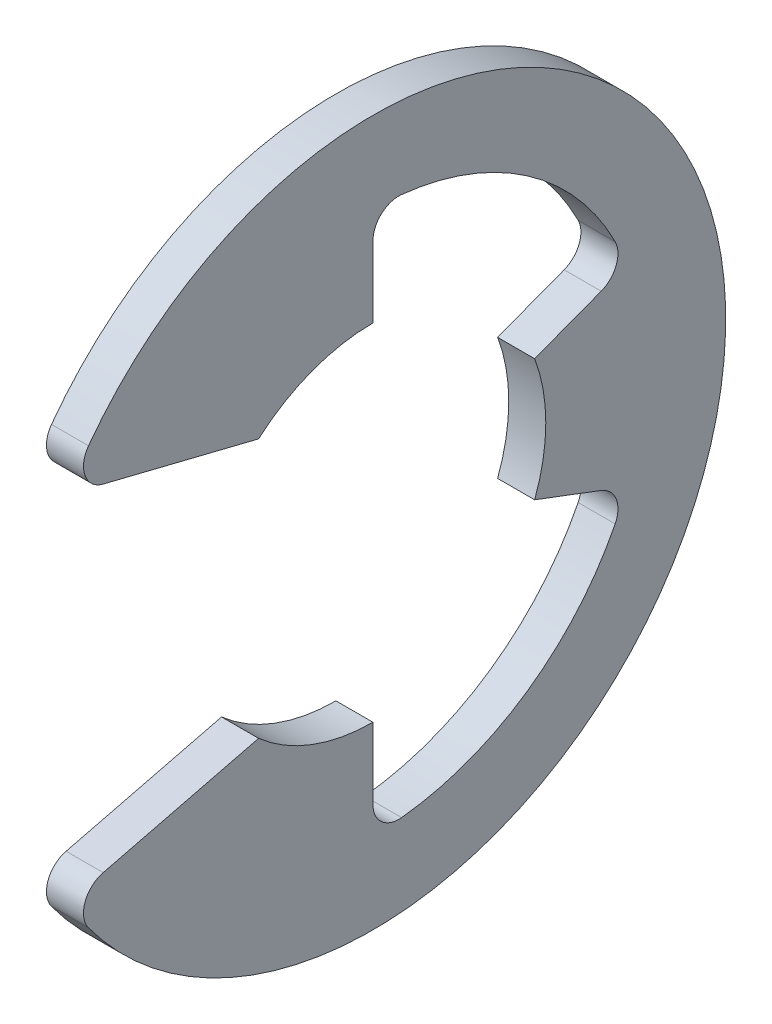
ISO-10303-21;
HEADER;
FILE_DESCRIPTION(('STEP AP214'),'2;1');
FILE_NAME('part.step','',(''),(''),'','','');
FILE_SCHEMA(('AUTOMOTIVE_DESIGN { 1 0 10303 214 1 1 1 1 }'));
ENDSEC;
DATA;
#1=APPLICATION_CONTEXT('core data for automotive mechanical design processes');
#2=APPLICATION_PROTOCOL_DEFINITION('international standard','automotive_design',2000,#1);
#3=PRODUCT_CONTEXT('',#1,'mechanical');
#4=PRODUCT('Part','Part','',(#3));
#5=PRODUCT_RELATED_PRODUCT_CATEGORY('part','',(#4));
#6=PRODUCT_DEFINITION_FORMATION('','',#4);
#7=PRODUCT_DEFINITION_CONTEXT('part definition',#1,'design');
#8=PRODUCT_DEFINITION('design','',#6,#7);
#9=PRODUCT_DEFINITION_SHAPE('','',#8);
#10=(LENGTH_UNIT() NAMED_UNIT(*) SI_UNIT(.MILLI.,.METRE.));
#11=(NAMED_UNIT(*) PLANE_ANGLE_UNIT() SI_UNIT($,.RADIAN.));
#12=(NAMED_UNIT(*) SI_UNIT($,.STERADIAN.) SOLID_ANGLE_UNIT());
#13=UNCERTAINTY_MEASURE_WITH_UNIT(LENGTH_MEASURE(1.E-05),#10,'distance_accuracy_value','');
#14=(GEOMETRIC_REPRESENTATION_CONTEXT(3) GLOBAL_UNCERTAINTY_ASSIGNED_CONTEXT((#13)) GLOBAL_UNIT_ASSIGNED_CONTEXT((#10,
#11,#12)) REPRESENTATION_CONTEXT('',''));
#15=CARTESIAN_POINT('',(0.,0.,0.));
#16=DIRECTION('',(0.,0.,1.));
#17=DIRECTION('',(1.,0.,0.));
#18=AXIS2_PLACEMENT_3D('',#15,#16,#17);
#19=CARTESIAN_POINT('',(0.5334,0.,0.));
#20=DIRECTION('',(-1.,0.,0.));
#21=DIRECTION('',(0.,0.,1.));
#22=AXIS2_PLACEMENT_3D('',#19,#20,#21);
#23=CYLINDRICAL_SURFACE('',#22,10.16);
#24=CARTESIAN_POINT('',(0.5334,0.,0.));
#25=DIRECTION('',(1.,0.,0.));
#26=DIRECTION('',(0.,0.,-1.));
#27=AXIS2_PLACEMENT_3D('',#24,#25,#26);
#28=CIRCLE('',#27,10.16);
#29=CARTESIAN_POINT('',(0.5334,-6.01157023801035,8.19064242129201));
#30=VERTEX_POINT('',#29);
#31=CARTESIAN_POINT('',(0.5334,6.01157023801035,8.19064242129201));
#32=VERTEX_POINT('',#31);
#33=EDGE_CURVE('E173',#30,#32,#28,.T.);
#34=ORIENTED_EDGE('',*,*,#33,.F.);
#35=DIRECTION('',(-1.,0.,0.));
#36=VECTOR('',#35,1.);
#37=CARTESIAN_POINT('',(0.5334,-6.01157023801035,8.190642421292));
#38=LINE('',#37,#36);
#39=CARTESIAN_POINT('',(-0.5334,-6.01157023801035,8.19064242129201));
#40=VERTEX_POINT('',#39);
#41=EDGE_CURVE('E267',#30,#40,#38,.T.);
#42=ORIENTED_EDGE('',*,*,#41,.T.);
#43=CARTESIAN_POINT('',(-0.5334,0.,0.));
#44=DIRECTION('',(1.,0.,0.));
#45=DIRECTION('',(0.,0.,-1.));
#46=AXIS2_PLACEMENT_3D('',#43,#44,#45);
#47=CIRCLE('',#46,10.16);
#48=CARTESIAN_POINT('',(-0.5334,6.01157023801035,8.19064242129201));
#49=VERTEX_POINT('',#48);
#50=EDGE_CURVE('E211',#40,#49,#47,.T.);
#51=ORIENTED_EDGE('',*,*,#50,.T.);
#52=DIRECTION('',(-1.,0.,0.));
#53=VECTOR('',#52,1.);
#54=CARTESIAN_POINT('',(0.5334,6.01157023801035,8.19064242129201));
#55=LINE('',#54,#53);
#56=EDGE_CURVE('E265',#49,#32,#55,.F.);
#57=ORIENTED_EDGE('',*,*,#56,.T.);
#58=EDGE_LOOP('',(#34,#42,#51,#57));
#59=FACE_BOUND('',#58,.T.);
#60=ADVANCED_FACE('F35',(#59),#23,.T.);
#61=CARTESIAN_POINT('',(0.5334,5.09813480407811,8.78832302088672));
#62=DIRECTION('',(0.,0.970536829925373,-0.240952820606873));
#63=DIRECTION('',(0.,0.240952820606873,0.970536829925373));
#64=AXIS2_PLACEMENT_3D('',#61,#62,#63);
#65=PLANE('',#64);
#66=DIRECTION('',(0.,-0.240952820606873,-0.970536829925373));
#67=VECTOR('',#66,1.);
#68=CARTESIAN_POINT('',(0.5334,5.09813480407811,8.78832302088672));
#69=LINE('',#68,#67);
#70=CARTESIAN_POINT('',(0.5334,4.84496174240152,7.76856413164343));
#71=VERTEX_POINT('',#70);
#72=CARTESIAN_POINT('',(0.5334,3.7338,3.29290208175099));
#73=VERTEX_POINT('',#72);
#74=EDGE_CURVE('E159',#71,#73,#69,.T.);
#75=ORIENTED_EDGE('',*,*,#74,.F.);
#76=DIRECTION('',(-1.,0.,0.));
#77=VECTOR('',#76,1.);
#78=CARTESIAN_POINT('',(0.5334,4.84496174240152,7.76856413164343));
#79=LINE('',#78,#77);
#80=CARTESIAN_POINT('',(-0.5334,4.84496174240152,7.76856413164343));
#81=VERTEX_POINT('',#80);
#82=EDGE_CURVE('E279',#71,#81,#79,.T.);
#83=ORIENTED_EDGE('',*,*,#82,.T.);
#84=DIRECTION('',(0.,-0.240952820606873,-0.970536829925373));
#85=VECTOR('',#84,1.);
#86=CARTESIAN_POINT('',(-0.5334,5.09813480407811,8.78832302088672));
#87=LINE('',#86,#85);
#88=CARTESIAN_POINT('',(-0.5334,3.7338,3.29290208175099));
#89=VERTEX_POINT('',#88);
#90=EDGE_CURVE('E179',#81,#89,#87,.T.);
#91=ORIENTED_EDGE('',*,*,#90,.T.);
#92=DIRECTION('',(-1.,0.,0.));
#93=VECTOR('',#92,1.);
#94=CARTESIAN_POINT('',(0.5334,3.7338,3.29290208175099));
#95=LINE('',#94,#93);
#96=EDGE_CURVE('E176',#73,#89,#95,.T.);
#97=ORIENTED_EDGE('',*,*,#96,.F.);
#98=EDGE_LOOP('',(#75,#83,#91,#97));
#99=FACE_BOUND('',#98,.T.);
#100=ADVANCED_FACE('F177',(#99),#65,.F.);
#101=CARTESIAN_POINT('',(0.5334,0.,0.));
#102=DIRECTION('',(-1.,0.,0.));
#103=DIRECTION('',(0.,0.,1.));
#104=AXIS2_PLACEMENT_3D('',#101,#102,#103);
#105=CYLINDRICAL_SURFACE('',#104,4.9784);
#106=CARTESIAN_POINT('',(-0.5334,0.,0.));
#107=DIRECTION('',(-1.,0.,0.));
#108=DIRECTION('',(0.,0.,1.));
#109=AXIS2_PLACEMENT_3D('',#106,#107,#108);
#110=CIRCLE('',#109,4.9784);
#111=CARTESIAN_POINT('',(-0.5334,4.9784,0.));
#112=VERTEX_POINT('',#111);
#113=EDGE_CURVE('E215',#89,#112,#110,.T.);
#114=ORIENTED_EDGE('',*,*,#113,.T.);
#115=DIRECTION('',(-1.,0.,0.));
#116=VECTOR('',#115,1.);
#117=CARTESIAN_POINT('',(0.5334,4.9784,0.));
#118=LINE('',#117,#116);
#119=CARTESIAN_POINT('',(0.5334,4.9784,0.));
#120=VERTEX_POINT('',#119);
#121=EDGE_CURVE('E183',#120,#112,#118,.T.);
#122=ORIENTED_EDGE('',*,*,#121,.F.);
#123=CARTESIAN_POINT('',(0.5334,0.,0.));
#124=DIRECTION('',(-1.,0.,0.));
#125=DIRECTION('',(0.,0.,1.));
#126=AXIS2_PLACEMENT_3D('',#123,#124,#125);
#127=CIRCLE('',#126,4.9784);
#128=EDGE_CURVE('E165',#73,#120,#127,.T.);
#129=ORIENTED_EDGE('',*,*,#128,.F.);
#130=ORIENTED_EDGE('',*,*,#96,.T.);
#131=EDGE_LOOP('',(#114,#122,#129,#130));
#132=FACE_BOUND('',#131,.T.);
#133=ADVANCED_FACE('F185',(#132),#105,.F.);
#134=CARTESIAN_POINT('',(0.5334,4.9784,0.));
#135=DIRECTION('',(0.,0.,1.));
#136=DIRECTION('',(0.,-1.,0.));
#137=AXIS2_PLACEMENT_3D('',#134,#135,#136);
#138=PLANE('',#137);
#139=DIRECTION('',(0.,1.,0.));
#140=VECTOR('',#139,1.);
#141=CARTESIAN_POINT('',(-0.5334,4.9784,0.));
#142=LINE('',#141,#140);
#143=CARTESIAN_POINT('',(-0.5334,7.02704023617216,0.));
#144=VERTEX_POINT('',#143);
#145=EDGE_CURVE('E217',#112,#144,#142,.T.);
#146=ORIENTED_EDGE('',*,*,#145,.T.);
#147=DIRECTION('',(1.,0.,0.));
#148=VECTOR('',#147,1.);
#149=CARTESIAN_POINT('',(0.5334,7.02704023617216,0.));
#150=LINE('',#149,#148);
#151=CARTESIAN_POINT('',(0.5334,7.02704023617216,0.));
#152=VERTEX_POINT('',#151);
#153=EDGE_CURVE('E263',#144,#152,#150,.T.);
#154=ORIENTED_EDGE('',*,*,#153,.T.);
#155=DIRECTION('',(0.,1.,0.));
#156=VECTOR('',#155,1.);
#157=CARTESIAN_POINT('',(0.5334,4.9784,0.));
#158=LINE('',#157,#156);
#159=EDGE_CURVE('E188',#120,#152,#158,.T.);
#160=ORIENTED_EDGE('',*,*,#159,.F.);
#161=ORIENTED_EDGE('',*,*,#121,.T.);
#162=EDGE_LOOP('',(#146,#154,#160,#161));
#163=FACE_BOUND('',#162,.T.);
#164=ADVANCED_FACE('F385',(#163),#138,.F.);
#165=CARTESIAN_POINT('',(0.5334,0.,0.));
#166=DIRECTION('',(-1.,0.,0.));
#167=DIRECTION('',(0.,0.,1.));
#168=AXIS2_PLACEMENT_3D('',#165,#166,#167);
#169=CYLINDRICAL_SURFACE('',#168,7.81336774193549);
#170=CARTESIAN_POINT('',(0.5334,0.,0.));
#171=DIRECTION('',(-1.,0.,0.));
#172=DIRECTION('',(0.,0.,-1.));
#173=AXIS2_PLACEMENT_3D('',#170,#171,#172);
#174=CIRCLE('',#173,7.81336774193549);
#175=CARTESIAN_POINT('',(0.5334,7.76961896112721,-0.825673464276603));
#176=VERTEX_POINT('',#175);
#177=CARTESIAN_POINT('',(0.5334,3.51932193149276,-6.97589339176224));
#178=VERTEX_POINT('',#177);
#179=EDGE_CURVE('E190',#176,#178,#174,.T.);
#180=ORIENTED_EDGE('',*,*,#179,.F.);
#181=DIRECTION('',(-1.,0.,0.));
#182=VECTOR('',#181,1.);
#183=CARTESIAN_POINT('',(0.5334,7.76961896112721,-0.825673464276603));
#184=LINE('',#183,#182);
#185=CARTESIAN_POINT('',(-0.5334,7.76961896112721,-0.825673464276603));
#186=VERTEX_POINT('',#185);
#187=EDGE_CURVE('E260',#176,#186,#184,.T.);
#188=ORIENTED_EDGE('',*,*,#187,.T.);
#189=CARTESIAN_POINT('',(-0.5334,0.,0.));
#190=DIRECTION('',(-1.,0.,0.));
#191=DIRECTION('',(0.,0.,-1.));
#192=AXIS2_PLACEMENT_3D('',#189,#190,#191);
#193=CIRCLE('',#192,7.81336774193549);
#194=CARTESIAN_POINT('',(-0.5334,3.51932193149276,-6.97589339176224));
#195=VERTEX_POINT('',#194);
#196=EDGE_CURVE('E220',#186,#195,#193,.T.);
#197=ORIENTED_EDGE('',*,*,#196,.T.);
#198=DIRECTION('',(-1.,0.,0.));
#199=VECTOR('',#198,1.);
#200=CARTESIAN_POINT('',(0.5334,3.51932193149276,-6.97589339176224));
#201=LINE('',#200,#199);
#202=EDGE_CURVE('E258',#195,#178,#201,.F.);
#203=ORIENTED_EDGE('',*,*,#202,.T.);
#204=EDGE_LOOP('',(#180,#188,#197,#203));
#205=FACE_BOUND('',#204,.T.);
#206=ADVANCED_FACE('F307',(#205),#169,.F.);
#207=CARTESIAN_POINT('',(0.5334,1.76013019972955,-4.65686678357885));
#208=DIRECTION('',(0.,-0.935414346693485,-0.353553390593274));
#209=DIRECTION('',(0.,0.353553390593274,-0.935414346693485));
#210=AXIS2_PLACEMENT_3D('',#207,#208,#209);
#211=PLANE('',#210);
#212=DIRECTION('',(0.,-0.353553390593274,0.935414346693485));
#213=VECTOR('',#212,1.);
#214=CARTESIAN_POINT('',(0.5334,1.76013019972955,-4.65686678357885));
#215=LINE('',#214,#213);
#216=CARTESIAN_POINT('',(0.5334,2.48443390133403,-6.57319425170782));
#217=VERTEX_POINT('',#216);
#218=CARTESIAN_POINT('',(0.5334,1.76013019972956,-4.65686678357885));
#219=VERTEX_POINT('',#218);
#220=EDGE_CURVE('E195',#217,#219,#215,.T.);
#221=ORIENTED_EDGE('',*,*,#220,.F.);
#222=DIRECTION('',(1.,0.,0.));
#223=VECTOR('',#222,1.);
#224=CARTESIAN_POINT('',(-0.5334,2.48443390133403,-6.57319425170782));
#225=LINE('',#224,#223);
#226=CARTESIAN_POINT('',(-0.5334,2.48443390133403,-6.57319425170782));
#227=VERTEX_POINT('',#226);
#228=EDGE_CURVE('E282',#217,#227,#225,.F.);
#229=ORIENTED_EDGE('',*,*,#228,.T.);
#230=DIRECTION('',(0.,-0.353553390593274,0.935414346693485));
#231=VECTOR('',#230,1.);
#232=CARTESIAN_POINT('',(-0.5334,1.76013019972955,-4.65686678357885));
#233=LINE('',#232,#231);
#234=CARTESIAN_POINT('',(-0.5334,1.76013019972956,-4.65686678357885));
#235=VERTEX_POINT('',#234);
#236=EDGE_CURVE('E223',#227,#235,#233,.T.);
#237=ORIENTED_EDGE('',*,*,#236,.T.);
#238=DIRECTION('',(-1.,0.,0.));
#239=VECTOR('',#238,1.);
#240=CARTESIAN_POINT('',(0.5334,1.76013019972956,-4.65686678357885));
#241=LINE('',#240,#239);
#242=EDGE_CURVE('E247',#219,#235,#241,.T.);
#243=ORIENTED_EDGE('',*,*,#242,.F.);
#244=EDGE_LOOP('',(#221,#229,#237,#243));
#245=FACE_BOUND('',#244,.T.);
#246=ADVANCED_FACE('F310',(#245),#211,.F.);
#247=CARTESIAN_POINT('',(0.5334,0.,0.));
#248=DIRECTION('',(-1.,0.,0.));
#249=DIRECTION('',(0.,0.,1.));
#250=AXIS2_PLACEMENT_3D('',#247,#248,#249);
#251=CYLINDRICAL_SURFACE('',#250,4.9784);
#252=CARTESIAN_POINT('',(-0.5334,0.,0.));
#253=DIRECTION('',(-1.,0.,0.));
#254=DIRECTION('',(0.,0.,1.));
#255=AXIS2_PLACEMENT_3D('',#252,#253,#254);
#256=CIRCLE('',#255,4.9784);
#257=CARTESIAN_POINT('',(-0.5334,-1.76013019972955,-4.65686678357885));
#258=VERTEX_POINT('',#257);
#259=EDGE_CURVE('E225',#235,#258,#256,.T.);
#260=ORIENTED_EDGE('',*,*,#259,.T.);
#261=DIRECTION('',(-1.,0.,0.));
#262=VECTOR('',#261,1.);
#263=CARTESIAN_POINT('',(0.5334,-1.76013019972955,-4.65686678357885));
#264=LINE('',#263,#262);
#265=CARTESIAN_POINT('',(0.5334,-1.76013019972955,-4.65686678357885));
#266=VERTEX_POINT('',#265);
#267=EDGE_CURVE('E244',#266,#258,#264,.T.);
#268=ORIENTED_EDGE('',*,*,#267,.F.);
#269=CARTESIAN_POINT('',(0.5334,0.,0.));
#270=DIRECTION('',(-1.,0.,0.));
#271=DIRECTION('',(0.,0.,1.));
#272=AXIS2_PLACEMENT_3D('',#269,#270,#271);
#273=CIRCLE('',#272,4.9784);
#274=EDGE_CURVE('E197',#219,#266,#273,.T.);
#275=ORIENTED_EDGE('',*,*,#274,.F.);
#276=ORIENTED_EDGE('',*,*,#242,.T.);
#277=EDGE_LOOP('',(#260,#268,#275,#276));
#278=FACE_BOUND('',#277,.T.);
#279=ADVANCED_FACE('F316',(#278),#251,.F.);
#280=CARTESIAN_POINT('',(0.5334,-1.76013019972955,-4.65686678357885));
#281=DIRECTION('',(0.,0.935414346693485,-0.353553390593274));
#282=DIRECTION('',(0.,0.353553390593274,0.935414346693485));
#283=AXIS2_PLACEMENT_3D('',#280,#281,#282);
#284=PLANE('',#283);
#285=DIRECTION('',(0.,-0.353553390593274,-0.935414346693485));
#286=VECTOR('',#285,1.);
#287=CARTESIAN_POINT('',(-0.5334,-1.76013019972955,-4.65686678357885));
#288=LINE('',#287,#286);
#289=CARTESIAN_POINT('',(-0.5334,-2.48443390133403,-6.57319425170782));
#290=VERTEX_POINT('',#289);
#291=EDGE_CURVE('E227',#258,#290,#288,.T.);
#292=ORIENTED_EDGE('',*,*,#291,.T.);
#293=DIRECTION('',(1.,0.,0.));
#294=VECTOR('',#293,1.);
#295=CARTESIAN_POINT('',(0.5334,-2.48443390133403,-6.57319425170782));
#296=LINE('',#295,#294);
#297=CARTESIAN_POINT('',(0.5334,-2.48443390133403,-6.57319425170782));
#298=VERTEX_POINT('',#297);
#299=EDGE_CURVE('E50',#290,#298,#296,.T.);
#300=ORIENTED_EDGE('',*,*,#299,.T.);
#301=DIRECTION('',(0.,-0.353553390593274,-0.935414346693485));
#302=VECTOR('',#301,1.);
#303=CARTESIAN_POINT('',(0.5334,-1.76013019972955,-4.65686678357885));
#304=LINE('',#303,#302);
#305=EDGE_CURVE('E199',#266,#298,#304,.T.);
#306=ORIENTED_EDGE('',*,*,#305,.F.);
#307=ORIENTED_EDGE('',*,*,#267,.T.);
#308=EDGE_LOOP('',(#292,#300,#306,#307));
#309=FACE_BOUND('',#308,.T.);
#310=ADVANCED_FACE('F318',(#309),#284,.F.);
#311=CARTESIAN_POINT('',(0.5334,0.,0.));
#312=DIRECTION('',(-1.,0.,0.));
#313=DIRECTION('',(0.,0.,1.));
#314=AXIS2_PLACEMENT_3D('',#311,#312,#313);
#315=CYLINDRICAL_SURFACE('',#314,7.81336774193548);
#316=CARTESIAN_POINT('',(-0.5334,0.,0.));
#317=DIRECTION('',(-1.,0.,0.));
#318=DIRECTION('',(0.,0.,-1.));
#319=AXIS2_PLACEMENT_3D('',#316,#317,#318);
#320=CIRCLE('',#319,7.81336774193548);
#321=CARTESIAN_POINT('',(-0.5334,-3.51932193149276,-6.97589339176224));
#322=VERTEX_POINT('',#321);
#323=CARTESIAN_POINT('',(-0.5334,-7.76961896112721,-0.825673464276605));
#324=VERTEX_POINT('',#323);
#325=EDGE_CURVE('E229',#322,#324,#320,.T.);
#326=ORIENTED_EDGE('',*,*,#325,.T.);
#327=DIRECTION('',(-1.,0.,0.));
#328=VECTOR('',#327,1.);
#329=CARTESIAN_POINT('',(0.5334,-7.76961896112721,-0.825673464276605));
#330=LINE('',#329,#328);
#331=CARTESIAN_POINT('',(0.5334,-7.76961896112721,-0.825673464276605));
#332=VERTEX_POINT('',#331);
#333=EDGE_CURVE('E256',#324,#332,#330,.F.);
#334=ORIENTED_EDGE('',*,*,#333,.T.);
#335=CARTESIAN_POINT('',(0.5334,0.,0.));
#336=DIRECTION('',(-1.,0.,0.));
#337=DIRECTION('',(0.,0.,-1.));
#338=AXIS2_PLACEMENT_3D('',#335,#336,#337);
#339=CIRCLE('',#338,7.81336774193548);
#340=CARTESIAN_POINT('',(0.5334,-3.51932193149276,-6.97589339176224));
#341=VERTEX_POINT('',#340);
#342=EDGE_CURVE('E201',#341,#332,#339,.T.);
#343=ORIENTED_EDGE('',*,*,#342,.F.);
#344=DIRECTION('',(-1.,0.,0.));
#345=VECTOR('',#344,1.);
#346=CARTESIAN_POINT('',(0.5334,-3.51932193149276,-6.97589339176224));
#347=LINE('',#346,#345);
#348=EDGE_CURVE('E253',#341,#322,#347,.T.);
#349=ORIENTED_EDGE('',*,*,#348,.T.);
#350=EDGE_LOOP('',(#326,#334,#343,#349));
#351=FACE_BOUND('',#350,.T.);
#352=ADVANCED_FACE('F320',(#351),#315,.F.);
#353=CARTESIAN_POINT('',(0.5334,-4.9784,0.));
#354=DIRECTION('',(0.,0.,1.));
#355=DIRECTION('',(0.,-1.,0.));
#356=AXIS2_PLACEMENT_3D('',#353,#354,#355);
#357=PLANE('',#356);
#358=DIRECTION('',(0.,1.,0.));
#359=VECTOR('',#358,1.);
#360=CARTESIAN_POINT('',(0.5334,-4.9784,0.));
#361=LINE('',#360,#359);
#362=CARTESIAN_POINT('',(0.5334,-7.02704023617216,0.));
#363=VERTEX_POINT('',#362);
#364=CARTESIAN_POINT('',(0.5334,-4.9784,0.));
#365=VERTEX_POINT('',#364);
#366=EDGE_CURVE('E204',#363,#365,#361,.T.);
#367=ORIENTED_EDGE('',*,*,#366,.F.);
#368=DIRECTION('',(1.,0.,0.));
#369=VECTOR('',#368,1.);
#370=CARTESIAN_POINT('',(-0.5334,-7.02704023617216,0.));
#371=LINE('',#370,#369);
#372=CARTESIAN_POINT('',(-0.5334,-7.02704023617216,0.));
#373=VERTEX_POINT('',#372);
#374=EDGE_CURVE('E182',#363,#373,#371,.F.);
#375=ORIENTED_EDGE('',*,*,#374,.T.);
#376=DIRECTION('',(0.,1.,0.));
#377=VECTOR('',#376,1.);
#378=CARTESIAN_POINT('',(-0.5334,-4.9784,0.));
#379=LINE('',#378,#377);
#380=CARTESIAN_POINT('',(-0.5334,-4.9784,0.));
#381=VERTEX_POINT('',#380);
#382=EDGE_CURVE('E232',#373,#381,#379,.T.);
#383=ORIENTED_EDGE('',*,*,#382,.T.);
#384=DIRECTION('',(-1.,0.,0.));
#385=VECTOR('',#384,1.);
#386=CARTESIAN_POINT('',(0.5334,-4.9784,0.));
#387=LINE('',#386,#385);
#388=EDGE_CURVE('E241',#365,#381,#387,.T.);
#389=ORIENTED_EDGE('',*,*,#388,.F.);
#390=EDGE_LOOP('',(#367,#375,#383,#389));
#391=FACE_BOUND('',#390,.T.);
#392=ADVANCED_FACE('F326',(#391),#357,.F.);
#393=CARTESIAN_POINT('',(0.5334,0.,0.));
#394=DIRECTION('',(-1.,0.,0.));
#395=DIRECTION('',(0.,0.,1.));
#396=AXIS2_PLACEMENT_3D('',#393,#394,#395);
#397=CYLINDRICAL_SURFACE('',#396,4.9784);
#398=CARTESIAN_POINT('',(-0.5334,0.,0.));
#399=DIRECTION('',(-1.,0.,0.));
#400=DIRECTION('',(0.,0.,-1.));
#401=AXIS2_PLACEMENT_3D('',#398,#399,#400);
#402=CIRCLE('',#401,4.9784);
#403=CARTESIAN_POINT('',(-0.5334,-3.7338,3.29290208175099));
#404=VERTEX_POINT('',#403);
#405=EDGE_CURVE('E234',#381,#404,#402,.T.);
#406=ORIENTED_EDGE('',*,*,#405,.T.);
#407=DIRECTION('',(-1.,0.,0.));
#408=VECTOR('',#407,1.);
#409=CARTESIAN_POINT('',(0.5334,-3.7338,3.29290208175099));
#410=LINE('',#409,#408);
#411=CARTESIAN_POINT('',(0.5334,-3.7338,3.29290208175099));
#412=VERTEX_POINT('',#411);
#413=EDGE_CURVE('E210',#412,#404,#410,.T.);
#414=ORIENTED_EDGE('',*,*,#413,.F.);
#415=CARTESIAN_POINT('',(0.5334,0.,0.));
#416=DIRECTION('',(-1.,0.,0.));
#417=DIRECTION('',(0.,0.,-1.));
#418=AXIS2_PLACEMENT_3D('',#415,#416,#417);
#419=CIRCLE('',#418,4.9784);
#420=EDGE_CURVE('E206',#365,#412,#419,.T.);
#421=ORIENTED_EDGE('',*,*,#420,.F.);
#422=ORIENTED_EDGE('',*,*,#388,.T.);
#423=EDGE_LOOP('',(#406,#414,#421,#422));
#424=FACE_BOUND('',#423,.T.);
#425=ADVANCED_FACE('F375',(#424),#397,.F.);
#426=CARTESIAN_POINT('',(0.5334,-5.09813480407811,8.78832302088672));
#427=DIRECTION('',(0.,-0.970536829925373,-0.240952820606873));
#428=DIRECTION('',(0.,0.240952820606873,-0.970536829925373));
#429=AXIS2_PLACEMENT_3D('',#426,#427,#428);
#430=PLANE('',#429);
#431=DIRECTION('',(0.,-0.240952820606873,0.970536829925373));
#432=VECTOR('',#431,1.);
#433=CARTESIAN_POINT('',(-0.5334,-5.09813480407811,8.78832302088672));
#434=LINE('',#433,#432);
#435=CARTESIAN_POINT('',(-0.5334,-4.84496174240152,7.76856413164343));
#436=VERTEX_POINT('',#435);
#437=EDGE_CURVE('E236',#404,#436,#434,.T.);
#438=ORIENTED_EDGE('',*,*,#437,.T.);
#439=DIRECTION('',(-1.,0.,0.));
#440=VECTOR('',#439,1.);
#441=CARTESIAN_POINT('',(0.5334,-4.84496174240152,7.76856413164343));
#442=LINE('',#441,#440);
#443=CARTESIAN_POINT('',(0.5334,-4.84496174240152,7.76856413164343));
#444=VERTEX_POINT('',#443);
#445=EDGE_CURVE('E274',#436,#444,#442,.F.);
#446=ORIENTED_EDGE('',*,*,#445,.T.);
#447=DIRECTION('',(0.,-0.240952820606873,0.970536829925373));
#448=VECTOR('',#447,1.);
#449=CARTESIAN_POINT('',(0.5334,-5.09813480407811,8.78832302088672));
#450=LINE('',#449,#448);
#451=EDGE_CURVE('E208',#412,#444,#450,.T.);
#452=ORIENTED_EDGE('',*,*,#451,.F.);
#453=ORIENTED_EDGE('',*,*,#413,.T.);
#454=EDGE_LOOP('',(#438,#446,#452,#453));
#455=FACE_BOUND('',#454,.T.);
#456=ADVANCED_FACE('F417',(#455),#430,.F.);
#457=CARTESIAN_POINT('',(0.5334,0.,0.));
#458=DIRECTION('',(1.,0.,0.));
#459=DIRECTION('',(0.,0.,-1.));
#460=AXIS2_PLACEMENT_3D('',#457,#458,#459);
#461=PLANE('',#460);
#462=ORIENTED_EDGE('',*,*,#451,.T.);
#463=CARTESIAN_POINT('',(0.5334,-5.56971982551659,7.58863020332704));
#464=DIRECTION('',(1.,0.,0.));
#465=DIRECTION('',(0.,0.,-1.));
#466=AXIS2_PLACEMENT_3D('',#463,#464,#465);
#467=CIRCLE('',#466,0.74676);
#468=EDGE_CURVE('E277',#444,#30,#467,.T.);
#469=ORIENTED_EDGE('',*,*,#468,.T.);
#470=ORIENTED_EDGE('',*,*,#33,.T.);
#471=CARTESIAN_POINT('',(0.5334,5.56971982551659,7.58863020332704));
#472=DIRECTION('',(1.,0.,0.));
#473=DIRECTION('',(0.,0.,-1.));
#474=AXIS2_PLACEMENT_3D('',#471,#472,#473);
#475=CIRCLE('',#474,0.74676);
#476=EDGE_CURVE('E169',#32,#71,#475,.T.);
#477=ORIENTED_EDGE('',*,*,#476,.T.);
#478=ORIENTED_EDGE('',*,*,#74,.T.);
#479=ORIENTED_EDGE('',*,*,#128,.T.);
#480=ORIENTED_EDGE('',*,*,#159,.T.);
#481=CARTESIAN_POINT('',(0.5334,7.02704023617216,-0.746759999999999));
#482=DIRECTION('',(1.,0.,0.));
#483=DIRECTION('',(0.,0.,-1.));
#484=AXIS2_PLACEMENT_3D('',#481,#482,#483);
#485=CIRCLE('',#484,0.74676);
#486=EDGE_CURVE('E291',#152,#176,#485,.F.);
#487=ORIENTED_EDGE('',*,*,#486,.T.);
#488=ORIENTED_EDGE('',*,*,#179,.T.);
#489=CARTESIAN_POINT('',(0.5334,3.18296391887086,-6.30917472174839));
#490=DIRECTION('',(1.,0.,0.));
#491=DIRECTION('',(0.,0.,-1.));
#492=AXIS2_PLACEMENT_3D('',#489,#490,#491);
#493=CIRCLE('',#492,0.74676);
#494=EDGE_CURVE('E11',#178,#217,#493,.F.);
#495=ORIENTED_EDGE('',*,*,#494,.T.);
#496=ORIENTED_EDGE('',*,*,#220,.T.);
#497=ORIENTED_EDGE('',*,*,#274,.T.);
#498=ORIENTED_EDGE('',*,*,#305,.T.);
#499=CARTESIAN_POINT('',(0.5334,-3.18296391887085,-6.30917472174839));
#500=DIRECTION('',(1.,0.,0.));
#501=DIRECTION('',(0.,0.,-1.));
#502=AXIS2_PLACEMENT_3D('',#499,#500,#501);
#503=CIRCLE('',#502,0.74676);
#504=EDGE_CURVE('E295',#298,#341,#503,.F.);
#505=ORIENTED_EDGE('',*,*,#504,.T.);
#506=ORIENTED_EDGE('',*,*,#342,.T.);
#507=CARTESIAN_POINT('',(0.5334,-7.02704023617216,-0.746760000000001));
#508=DIRECTION('',(1.,0.,0.));
#509=DIRECTION('',(0.,0.,-1.));
#510=AXIS2_PLACEMENT_3D('',#507,#508,#509);
#511=CIRCLE('',#510,0.74676);
#512=EDGE_CURVE('E287',#332,#363,#511,.F.);
#513=ORIENTED_EDGE('',*,*,#512,.T.);
#514=ORIENTED_EDGE('',*,*,#366,.T.);
#515=ORIENTED_EDGE('',*,*,#420,.T.);
#516=EDGE_LOOP('',(#462,#469,#470,#477,#478,#479,#480,#487,#488,#495,#496,#497,#498,#505,#506,
#513,#514,#515));
#517=FACE_BOUND('',#516,.T.);
#518=ADVANCED_FACE('F162',(#517),#461,.T.);
#519=CARTESIAN_POINT('',(-0.5334,0.,0.));
#520=DIRECTION('',(1.,0.,0.));
#521=DIRECTION('',(0.,0.,-1.));
#522=AXIS2_PLACEMENT_3D('',#519,#520,#521);
#523=PLANE('',#522);
#524=ORIENTED_EDGE('',*,*,#50,.F.);
#525=CARTESIAN_POINT('',(-0.5334,-5.56971982551659,7.58863020332704));
#526=DIRECTION('',(1.,0.,0.));
#527=DIRECTION('',(0.,0.,-1.));
#528=AXIS2_PLACEMENT_3D('',#525,#526,#527);
#529=CIRCLE('',#528,0.74676);
#530=EDGE_CURVE('E272',#40,#436,#529,.F.);
#531=ORIENTED_EDGE('',*,*,#530,.T.);
#532=ORIENTED_EDGE('',*,*,#437,.F.);
#533=ORIENTED_EDGE('',*,*,#405,.F.);
#534=ORIENTED_EDGE('',*,*,#382,.F.);
#535=CARTESIAN_POINT('',(-0.5334,-7.02704023617216,-0.746760000000001));
#536=DIRECTION('',(1.,0.,0.));
#537=DIRECTION('',(0.,0.,-1.));
#538=AXIS2_PLACEMENT_3D('',#535,#536,#537);
#539=CIRCLE('',#538,0.74676);
#540=EDGE_CURVE('E285',#373,#324,#539,.T.);
#541=ORIENTED_EDGE('',*,*,#540,.T.);
#542=ORIENTED_EDGE('',*,*,#325,.F.);
#543=CARTESIAN_POINT('',(-0.5334,-3.18296391887085,-6.30917472174839));
#544=DIRECTION('',(1.,0.,0.));
#545=DIRECTION('',(0.,0.,-1.));
#546=AXIS2_PLACEMENT_3D('',#543,#544,#545);
#547=CIRCLE('',#546,0.74676);
#548=EDGE_CURVE('E293',#322,#290,#547,.T.);
#549=ORIENTED_EDGE('',*,*,#548,.T.);
#550=ORIENTED_EDGE('',*,*,#291,.F.);
#551=ORIENTED_EDGE('',*,*,#259,.F.);
#552=ORIENTED_EDGE('',*,*,#236,.F.);
#553=CARTESIAN_POINT('',(-0.5334,3.18296391887086,-6.30917472174839));
#554=DIRECTION('',(1.,0.,0.));
#555=DIRECTION('',(0.,0.,-1.));
#556=AXIS2_PLACEMENT_3D('',#553,#554,#555);
#557=CIRCLE('',#556,0.74676);
#558=EDGE_CURVE('E43',#227,#195,#557,.T.);
#559=ORIENTED_EDGE('',*,*,#558,.T.);
#560=ORIENTED_EDGE('',*,*,#196,.F.);
#561=CARTESIAN_POINT('',(-0.5334,7.02704023617216,-0.746759999999999));
#562=DIRECTION('',(1.,0.,0.));
#563=DIRECTION('',(0.,0.,-1.));
#564=AXIS2_PLACEMENT_3D('',#561,#562,#563);
#565=CIRCLE('',#564,0.74676);
#566=EDGE_CURVE('E289',#186,#144,#565,.T.);
#567=ORIENTED_EDGE('',*,*,#566,.T.);
#568=ORIENTED_EDGE('',*,*,#145,.F.);
#569=ORIENTED_EDGE('',*,*,#113,.F.);
#570=ORIENTED_EDGE('',*,*,#90,.F.);
#571=CARTESIAN_POINT('',(-0.5334,5.56971982551659,7.58863020332704));
#572=DIRECTION('',(1.,0.,0.));
#573=DIRECTION('',(0.,0.,-1.));
#574=AXIS2_PLACEMENT_3D('',#571,#572,#573);
#575=CIRCLE('',#574,0.74676);
#576=EDGE_CURVE('E270',#81,#49,#575,.F.);
#577=ORIENTED_EDGE('',*,*,#576,.T.);
#578=EDGE_LOOP('',(#524,#531,#532,#533,#534,#541,#542,#549,#550,#551,#552,#559,#560,#567,#568,
#569,#570,#577));
#579=FACE_BOUND('',#578,.T.);
#580=ADVANCED_FACE('F300',(#579),#523,.F.);
#581=CARTESIAN_POINT('',(0.5334,-7.02704023617216,-0.746760000000001));
#582=DIRECTION('',(-1.,0.,0.));
#583=DIRECTION('',(0.,0.,1.));
#584=AXIS2_PLACEMENT_3D('',#581,#582,#583);
#585=CYLINDRICAL_SURFACE('',#584,0.74676);
#586=ORIENTED_EDGE('',*,*,#512,.F.);
#587=ORIENTED_EDGE('',*,*,#333,.F.);
#588=ORIENTED_EDGE('',*,*,#540,.F.);
#589=ORIENTED_EDGE('',*,*,#374,.F.);
#590=EDGE_LOOP('',(#586,#587,#588,#589));
#591=FACE_BOUND('',#590,.T.);
#592=ADVANCED_FACE('F340',(#591),#585,.F.);
#593=CARTESIAN_POINT('',(0.5334,7.02704023617216,-0.746759999999999));
#594=DIRECTION('',(-1.,0.,0.));
#595=DIRECTION('',(0.,0.,1.));
#596=AXIS2_PLACEMENT_3D('',#593,#594,#595);
#597=CYLINDRICAL_SURFACE('',#596,0.74676);
#598=ORIENTED_EDGE('',*,*,#486,.F.);
#599=ORIENTED_EDGE('',*,*,#153,.F.);
#600=ORIENTED_EDGE('',*,*,#566,.F.);
#601=ORIENTED_EDGE('',*,*,#187,.F.);
#602=EDGE_LOOP('',(#598,#599,#600,#601));
#603=FACE_BOUND('',#602,.T.);
#604=ADVANCED_FACE('F343',(#603),#597,.F.);
#605=CARTESIAN_POINT('',(0.5334,-5.56971982551659,7.58863020332704));
#606=DIRECTION('',(-1.,0.,0.));
#607=DIRECTION('',(0.,0.,1.));
#608=AXIS2_PLACEMENT_3D('',#605,#606,#607);
#609=CYLINDRICAL_SURFACE('',#608,0.74676);
#610=ORIENTED_EDGE('',*,*,#468,.F.);
#611=ORIENTED_EDGE('',*,*,#445,.F.);
#612=ORIENTED_EDGE('',*,*,#530,.F.);
#613=ORIENTED_EDGE('',*,*,#41,.F.);
#614=EDGE_LOOP('',(#610,#611,#612,#613));
#615=FACE_BOUND('',#614,.T.);
#616=ADVANCED_FACE('F347',(#615),#609,.T.);
#617=CARTESIAN_POINT('',(0.5334,5.56971982551659,7.58863020332704));
#618=DIRECTION('',(-1.,0.,0.));
#619=DIRECTION('',(0.,0.,1.));
#620=AXIS2_PLACEMENT_3D('',#617,#618,#619);
#621=CYLINDRICAL_SURFACE('',#620,0.74676);
#622=ORIENTED_EDGE('',*,*,#476,.F.);
#623=ORIENTED_EDGE('',*,*,#56,.F.);
#624=ORIENTED_EDGE('',*,*,#576,.F.);
#625=ORIENTED_EDGE('',*,*,#82,.F.);
#626=EDGE_LOOP('',(#622,#623,#624,#625));
#627=FACE_BOUND('',#626,.T.);
#628=ADVANCED_FACE('F351',(#627),#621,.T.);
#629=CARTESIAN_POINT('',(0.5334,-3.18296391887085,-6.30917472174839));
#630=DIRECTION('',(-1.,0.,0.));
#631=DIRECTION('',(0.,0.,1.));
#632=AXIS2_PLACEMENT_3D('',#629,#630,#631);
#633=CYLINDRICAL_SURFACE('',#632,0.74676);
#634=ORIENTED_EDGE('',*,*,#504,.F.);
#635=ORIENTED_EDGE('',*,*,#299,.F.);
#636=ORIENTED_EDGE('',*,*,#548,.F.);
#637=ORIENTED_EDGE('',*,*,#348,.F.);
#638=EDGE_LOOP('',(#634,#635,#636,#637));
#639=FACE_BOUND('',#638,.T.);
#640=ADVANCED_FACE('F354',(#639),#633,.F.);
#641=CARTESIAN_POINT('',(0.5334,3.18296391887086,-6.30917472174839));
#642=DIRECTION('',(-1.,0.,0.));
#643=DIRECTION('',(0.,0.,1.));
#644=AXIS2_PLACEMENT_3D('',#641,#642,#643);
#645=CYLINDRICAL_SURFACE('',#644,0.74676);
#646=ORIENTED_EDGE('',*,*,#494,.F.);
#647=ORIENTED_EDGE('',*,*,#202,.F.);
#648=ORIENTED_EDGE('',*,*,#558,.F.);
#649=ORIENTED_EDGE('',*,*,#228,.F.);
#650=EDGE_LOOP('',(#646,#647,#648,#649));
#651=FACE_BOUND('',#650,.T.);
#652=ADVANCED_FACE('F37',(#651),#645,.F.);
#653=CLOSED_SHELL('',(#60,#100,#133,#164,#206,#246,#279,#310,#352,#392,#425,#456,#518,#580,#592,
#604,#616,#628,#640,#652));
#654=MANIFOLD_SOLID_BREP('B2',#653);
#655=ADVANCED_BREP_SHAPE_REPRESENTATION('',(#18,#654),#14);
#656=SHAPE_DEFINITION_REPRESENTATION(#9,#655);
ENDSEC;
END-ISO-10303-21;
